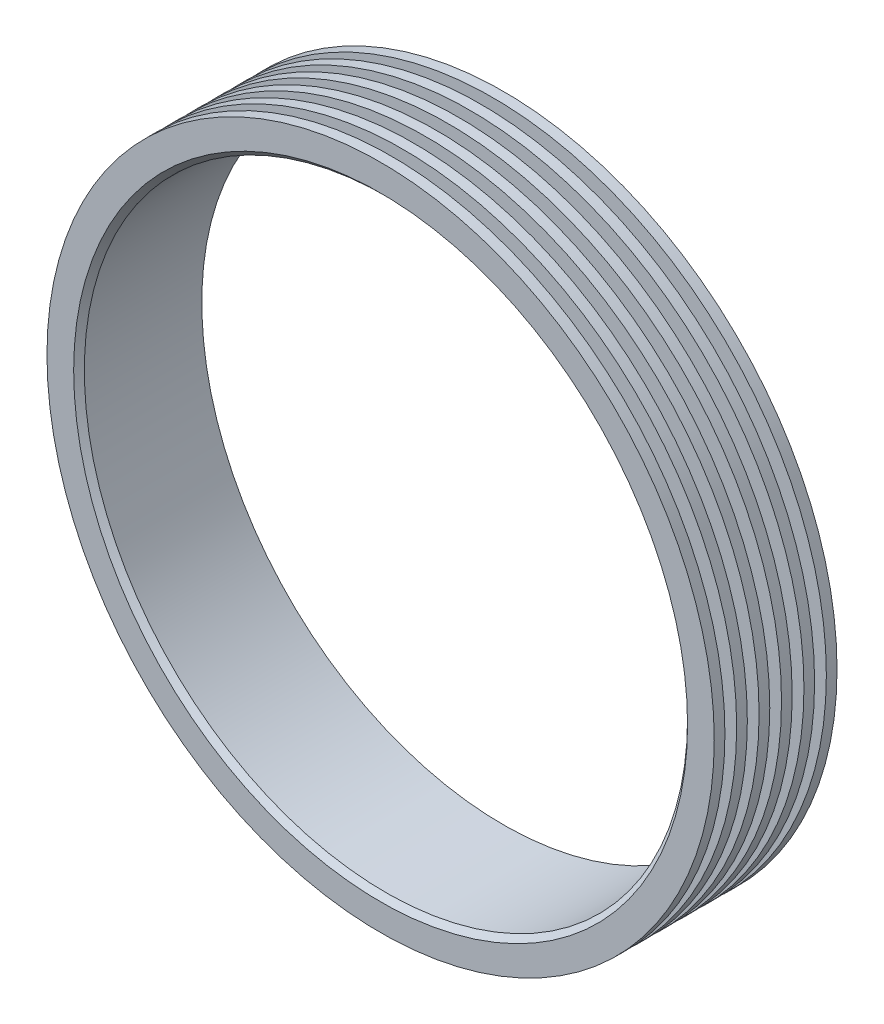
ISO-10303-21;
HEADER;
FILE_DESCRIPTION(('STEP AP214'),'2;1');
FILE_NAME('part.step','',(''),(''),'','','');
FILE_SCHEMA(('AUTOMOTIVE_DESIGN { 1 0 10303 214 1 1 1 1 }'));
ENDSEC;
DATA;
#1=APPLICATION_CONTEXT('core data for automotive mechanical design processes');
#2=APPLICATION_PROTOCOL_DEFINITION('international standard','automotive_design',2000,#1);
#3=PRODUCT_CONTEXT('',#1,'mechanical');
#4=PRODUCT('Part','Part','',(#3));
#5=PRODUCT_RELATED_PRODUCT_CATEGORY('part','',(#4));
#6=PRODUCT_DEFINITION_FORMATION('','',#4);
#7=PRODUCT_DEFINITION_CONTEXT('part definition',#1,'design');
#8=PRODUCT_DEFINITION('design','',#6,#7);
#9=PRODUCT_DEFINITION_SHAPE('','',#8);
#10=(LENGTH_UNIT() NAMED_UNIT(*) SI_UNIT(.MILLI.,.METRE.));
#11=(NAMED_UNIT(*) PLANE_ANGLE_UNIT() SI_UNIT($,.RADIAN.));
#12=(NAMED_UNIT(*) SI_UNIT($,.STERADIAN.) SOLID_ANGLE_UNIT());
#13=UNCERTAINTY_MEASURE_WITH_UNIT(LENGTH_MEASURE(1.E-05),#10,'distance_accuracy_value','');
#14=(GEOMETRIC_REPRESENTATION_CONTEXT(3) GLOBAL_UNCERTAINTY_ASSIGNED_CONTEXT((#13)) GLOBAL_UNIT_ASSIGNED_CONTEXT((#10,
#11,#12)) REPRESENTATION_CONTEXT('',''));
#15=CARTESIAN_POINT('',(0.,0.,0.));
#16=DIRECTION('',(0.,0.,1.));
#17=DIRECTION('',(1.,0.,0.));
#18=AXIS2_PLACEMENT_3D('',#15,#16,#17);
#19=CARTESIAN_POINT('',(0.,56.5,-11.5));
#20=DIRECTION('',(0.,0.,1.));
#21=DIRECTION('',(1.,0.,0.));
#22=AXIS2_PLACEMENT_3D('',#19,#20,#21);
#23=PLANE('',#22);
#24=CARTESIAN_POINT('',(0.,0.,-11.5));
#25=DIRECTION('',(0.,0.,1.));
#26=DIRECTION('',(1.,0.,0.));
#27=AXIS2_PLACEMENT_3D('',#24,#25,#26);
#28=CIRCLE('',#27,62.5);
#29=CARTESIAN_POINT('',(62.5,0.,-11.5));
#30=VERTEX_POINT('',#29);
#31=EDGE_CURVE('E39',#30,#30,#28,.T.);
#32=ORIENTED_EDGE('',*,*,#31,.F.);
#33=EDGE_LOOP('',(#32));
#34=FACE_BOUND('',#33,.T.);
#35=CARTESIAN_POINT('',(0.,0.,-11.5));
#36=DIRECTION('',(0.,0.,1.));
#37=DIRECTION('',(1.,0.,0.));
#38=AXIS2_PLACEMENT_3D('',#35,#36,#37);
#39=CIRCLE('',#38,56.5);
#40=CARTESIAN_POINT('',(56.5,0.,-11.5));
#41=VERTEX_POINT('',#40);
#42=EDGE_CURVE('E10',#41,#41,#39,.T.);
#43=ORIENTED_EDGE('',*,*,#42,.T.);
#44=EDGE_LOOP('',(#43));
#45=FACE_BOUND('',#44,.T.);
#46=ADVANCED_FACE('F33',(#34,#45),#23,.F.);
#47=CARTESIAN_POINT('',(0.,0.,0.));
#48=DIRECTION('',(0.,0.,1.));
#49=DIRECTION('',(1.,0.,0.));
#50=AXIS2_PLACEMENT_3D('',#47,#48,#49);
#51=CYLINDRICAL_SURFACE('',#50,62.5);
#52=CARTESIAN_POINT('',(0.,0.,-9.5));
#53=DIRECTION('',(0.,0.,1.));
#54=DIRECTION('',(1.,0.,0.));
#55=AXIS2_PLACEMENT_3D('',#52,#53,#54);
#56=CIRCLE('',#55,62.5);
#57=CARTESIAN_POINT('',(62.5,0.,-9.5));
#58=VERTEX_POINT('',#57);
#59=EDGE_CURVE('E43',#58,#58,#56,.T.);
#60=ORIENTED_EDGE('',*,*,#59,.F.);
#61=EDGE_LOOP('',(#60));
#62=FACE_BOUND('',#61,.T.);
#63=ORIENTED_EDGE('',*,*,#31,.T.);
#64=EDGE_LOOP('',(#63));
#65=FACE_BOUND('',#64,.T.);
#66=ADVANCED_FACE('F247',(#62,#65),#51,.T.);
#67=CARTESIAN_POINT('',(0.,62.5,-9.5));
#68=DIRECTION('',(0.,0.,-1.));
#69=DIRECTION('',(-1.,0.,0.));
#70=AXIS2_PLACEMENT_3D('',#67,#68,#69);
#71=PLANE('',#70);
#72=CARTESIAN_POINT('',(0.,0.,-9.5));
#73=DIRECTION('',(0.,0.,1.));
#74=DIRECTION('',(1.,0.,0.));
#75=AXIS2_PLACEMENT_3D('',#72,#73,#74);
#76=CIRCLE('',#75,58.5);
#77=CARTESIAN_POINT('',(58.5,0.,-9.5));
#78=VERTEX_POINT('',#77);
#79=EDGE_CURVE('E47',#78,#78,#76,.T.);
#80=ORIENTED_EDGE('',*,*,#79,.F.);
#81=EDGE_LOOP('',(#80));
#82=FACE_BOUND('',#81,.T.);
#83=ORIENTED_EDGE('',*,*,#59,.T.);
#84=EDGE_LOOP('',(#83));
#85=FACE_BOUND('',#84,.T.);
#86=ADVANCED_FACE('F241',(#82,#85),#71,.F.);
#87=CARTESIAN_POINT('',(0.,0.,0.));
#88=DIRECTION('',(0.,0.,1.));
#89=DIRECTION('',(1.,0.,0.));
#90=AXIS2_PLACEMENT_3D('',#87,#88,#89);
#91=CYLINDRICAL_SURFACE('',#90,58.5);
#92=CARTESIAN_POINT('',(0.,0.,-7.3));
#93=DIRECTION('',(0.,0.,1.));
#94=DIRECTION('',(1.,0.,0.));
#95=AXIS2_PLACEMENT_3D('',#92,#93,#94);
#96=CIRCLE('',#95,58.5);
#97=CARTESIAN_POINT('',(58.5,0.,-7.3));
#98=VERTEX_POINT('',#97);
#99=EDGE_CURVE('E52',#98,#98,#96,.T.);
#100=ORIENTED_EDGE('',*,*,#99,.F.);
#101=EDGE_LOOP('',(#100));
#102=FACE_BOUND('',#101,.T.);
#103=ORIENTED_EDGE('',*,*,#79,.T.);
#104=EDGE_LOOP('',(#103));
#105=FACE_BOUND('',#104,.T.);
#106=ADVANCED_FACE('F235',(#102,#105),#91,.T.);
#107=CARTESIAN_POINT('',(0.,62.5,-7.3));
#108=DIRECTION('',(0.,0.,1.));
#109=DIRECTION('',(1.,0.,0.));
#110=AXIS2_PLACEMENT_3D('',#107,#108,#109);
#111=PLANE('',#110);
#112=CARTESIAN_POINT('',(0.,0.,-7.3));
#113=DIRECTION('',(0.,0.,1.));
#114=DIRECTION('',(1.,0.,0.));
#115=AXIS2_PLACEMENT_3D('',#112,#113,#114);
#116=CIRCLE('',#115,62.5);
#117=CARTESIAN_POINT('',(62.5,0.,-7.3));
#118=VERTEX_POINT('',#117);
#119=EDGE_CURVE('E55',#118,#118,#116,.T.);
#120=ORIENTED_EDGE('',*,*,#119,.F.);
#121=EDGE_LOOP('',(#120));
#122=FACE_BOUND('',#121,.T.);
#123=ORIENTED_EDGE('',*,*,#99,.T.);
#124=EDGE_LOOP('',(#123));
#125=FACE_BOUND('',#124,.T.);
#126=ADVANCED_FACE('F229',(#122,#125),#111,.F.);
#127=CARTESIAN_POINT('',(0.,0.,0.));
#128=DIRECTION('',(0.,0.,1.));
#129=DIRECTION('',(1.,0.,0.));
#130=AXIS2_PLACEMENT_3D('',#127,#128,#129);
#131=CYLINDRICAL_SURFACE('',#130,62.5);
#132=CARTESIAN_POINT('',(0.,0.,-5.3));
#133=DIRECTION('',(0.,0.,1.));
#134=DIRECTION('',(1.,0.,0.));
#135=AXIS2_PLACEMENT_3D('',#132,#133,#134);
#136=CIRCLE('',#135,62.5);
#137=CARTESIAN_POINT('',(62.5,0.,-5.3));
#138=VERTEX_POINT('',#137);
#139=EDGE_CURVE('E58',#138,#138,#136,.T.);
#140=ORIENTED_EDGE('',*,*,#139,.F.);
#141=EDGE_LOOP('',(#140));
#142=FACE_BOUND('',#141,.T.);
#143=ORIENTED_EDGE('',*,*,#119,.T.);
#144=EDGE_LOOP('',(#143));
#145=FACE_BOUND('',#144,.T.);
#146=ADVANCED_FACE('F223',(#142,#145),#131,.T.);
#147=CARTESIAN_POINT('',(0.,62.5,-5.3));
#148=DIRECTION('',(0.,0.,-1.));
#149=DIRECTION('',(-1.,0.,0.));
#150=AXIS2_PLACEMENT_3D('',#147,#148,#149);
#151=PLANE('',#150);
#152=CARTESIAN_POINT('',(0.,0.,-5.3));
#153=DIRECTION('',(0.,0.,1.));
#154=DIRECTION('',(1.,0.,0.));
#155=AXIS2_PLACEMENT_3D('',#152,#153,#154);
#156=CIRCLE('',#155,58.5);
#157=CARTESIAN_POINT('',(58.5,0.,-5.3));
#158=VERTEX_POINT('',#157);
#159=EDGE_CURVE('E61',#158,#158,#156,.T.);
#160=ORIENTED_EDGE('',*,*,#159,.F.);
#161=EDGE_LOOP('',(#160));
#162=FACE_BOUND('',#161,.T.);
#163=ORIENTED_EDGE('',*,*,#139,.T.);
#164=EDGE_LOOP('',(#163));
#165=FACE_BOUND('',#164,.T.);
#166=ADVANCED_FACE('F217',(#162,#165),#151,.F.);
#167=CARTESIAN_POINT('',(0.,0.,0.));
#168=DIRECTION('',(0.,0.,1.));
#169=DIRECTION('',(1.,0.,0.));
#170=AXIS2_PLACEMENT_3D('',#167,#168,#169);
#171=CYLINDRICAL_SURFACE('',#170,58.5);
#172=CARTESIAN_POINT('',(0.,0.,-3.1));
#173=DIRECTION('',(0.,0.,1.));
#174=DIRECTION('',(1.,0.,0.));
#175=AXIS2_PLACEMENT_3D('',#172,#173,#174);
#176=CIRCLE('',#175,58.5);
#177=CARTESIAN_POINT('',(58.5,0.,-3.1));
#178=VERTEX_POINT('',#177);
#179=EDGE_CURVE('E64',#178,#178,#176,.T.);
#180=ORIENTED_EDGE('',*,*,#179,.F.);
#181=EDGE_LOOP('',(#180));
#182=FACE_BOUND('',#181,.T.);
#183=ORIENTED_EDGE('',*,*,#159,.T.);
#184=EDGE_LOOP('',(#183));
#185=FACE_BOUND('',#184,.T.);
#186=ADVANCED_FACE('F211',(#182,#185),#171,.T.);
#187=CARTESIAN_POINT('',(0.,62.4999999999999,-3.1));
#188=DIRECTION('',(0.,0.,1.));
#189=DIRECTION('',(1.,0.,0.));
#190=AXIS2_PLACEMENT_3D('',#187,#188,#189);
#191=PLANE('',#190);
#192=CARTESIAN_POINT('',(0.,0.,-3.1));
#193=DIRECTION('',(0.,0.,1.));
#194=DIRECTION('',(1.,0.,0.));
#195=AXIS2_PLACEMENT_3D('',#192,#193,#194);
#196=CIRCLE('',#195,62.4999999999999);
#197=CARTESIAN_POINT('',(62.4999999999999,0.,-3.1));
#198=VERTEX_POINT('',#197);
#199=EDGE_CURVE('E67',#198,#198,#196,.T.);
#200=ORIENTED_EDGE('',*,*,#199,.F.);
#201=EDGE_LOOP('',(#200));
#202=FACE_BOUND('',#201,.T.);
#203=ORIENTED_EDGE('',*,*,#179,.T.);
#204=EDGE_LOOP('',(#203));
#205=FACE_BOUND('',#204,.T.);
#206=ADVANCED_FACE('F205',(#202,#205),#191,.F.);
#207=CARTESIAN_POINT('',(0.,0.,0.));
#208=DIRECTION('',(0.,0.,1.));
#209=DIRECTION('',(1.,0.,0.));
#210=AXIS2_PLACEMENT_3D('',#207,#208,#209);
#211=CYLINDRICAL_SURFACE('',#210,62.4999999999999);
#212=CARTESIAN_POINT('',(0.,0.,-1.1));
#213=DIRECTION('',(0.,0.,1.));
#214=DIRECTION('',(1.,0.,0.));
#215=AXIS2_PLACEMENT_3D('',#212,#213,#214);
#216=CIRCLE('',#215,62.4999999999999);
#217=CARTESIAN_POINT('',(62.4999999999999,0.,-1.1));
#218=VERTEX_POINT('',#217);
#219=EDGE_CURVE('E70',#218,#218,#216,.T.);
#220=ORIENTED_EDGE('',*,*,#219,.F.);
#221=EDGE_LOOP('',(#220));
#222=FACE_BOUND('',#221,.T.);
#223=ORIENTED_EDGE('',*,*,#199,.T.);
#224=EDGE_LOOP('',(#223));
#225=FACE_BOUND('',#224,.T.);
#226=ADVANCED_FACE('F199',(#222,#225),#211,.T.);
#227=CARTESIAN_POINT('',(0.,62.4999999999999,-1.1));
#228=DIRECTION('',(0.,0.,-1.));
#229=DIRECTION('',(-1.,0.,0.));
#230=AXIS2_PLACEMENT_3D('',#227,#228,#229);
#231=PLANE('',#230);
#232=CARTESIAN_POINT('',(0.,0.,-1.1));
#233=DIRECTION('',(0.,0.,1.));
#234=DIRECTION('',(1.,0.,0.));
#235=AXIS2_PLACEMENT_3D('',#232,#233,#234);
#236=CIRCLE('',#235,58.4999999999999);
#237=CARTESIAN_POINT('',(58.4999999999999,0.,-1.1));
#238=VERTEX_POINT('',#237);
#239=EDGE_CURVE('E73',#238,#238,#236,.T.);
#240=ORIENTED_EDGE('',*,*,#239,.F.);
#241=EDGE_LOOP('',(#240));
#242=FACE_BOUND('',#241,.T.);
#243=ORIENTED_EDGE('',*,*,#219,.T.);
#244=EDGE_LOOP('',(#243));
#245=FACE_BOUND('',#244,.T.);
#246=ADVANCED_FACE('F193',(#242,#245),#231,.F.);
#247=CARTESIAN_POINT('',(0.,0.,0.));
#248=DIRECTION('',(0.,0.,1.));
#249=DIRECTION('',(1.,0.,0.));
#250=AXIS2_PLACEMENT_3D('',#247,#248,#249);
#251=CYLINDRICAL_SURFACE('',#250,58.4999999999999);
#252=CARTESIAN_POINT('',(0.,0.,1.1));
#253=DIRECTION('',(0.,0.,1.));
#254=DIRECTION('',(1.,0.,0.));
#255=AXIS2_PLACEMENT_3D('',#252,#253,#254);
#256=CIRCLE('',#255,58.4999999999999);
#257=CARTESIAN_POINT('',(58.4999999999999,0.,1.1));
#258=VERTEX_POINT('',#257);
#259=EDGE_CURVE('E76',#258,#258,#256,.T.);
#260=ORIENTED_EDGE('',*,*,#259,.F.);
#261=EDGE_LOOP('',(#260));
#262=FACE_BOUND('',#261,.T.);
#263=ORIENTED_EDGE('',*,*,#239,.T.);
#264=EDGE_LOOP('',(#263));
#265=FACE_BOUND('',#264,.T.);
#266=ADVANCED_FACE('F187',(#262,#265),#251,.T.);
#267=CARTESIAN_POINT('',(0.,62.4999999999999,1.1));
#268=DIRECTION('',(0.,0.,1.));
#269=DIRECTION('',(1.,0.,0.));
#270=AXIS2_PLACEMENT_3D('',#267,#268,#269);
#271=PLANE('',#270);
#272=CARTESIAN_POINT('',(0.,0.,1.1));
#273=DIRECTION('',(0.,0.,1.));
#274=DIRECTION('',(1.,0.,0.));
#275=AXIS2_PLACEMENT_3D('',#272,#273,#274);
#276=CIRCLE('',#275,62.4999999999999);
#277=CARTESIAN_POINT('',(62.4999999999999,0.,1.1));
#278=VERTEX_POINT('',#277);
#279=EDGE_CURVE('E79',#278,#278,#276,.T.);
#280=ORIENTED_EDGE('',*,*,#279,.F.);
#281=EDGE_LOOP('',(#280));
#282=FACE_BOUND('',#281,.T.);
#283=ORIENTED_EDGE('',*,*,#259,.T.);
#284=EDGE_LOOP('',(#283));
#285=FACE_BOUND('',#284,.T.);
#286=ADVANCED_FACE('F181',(#282,#285),#271,.F.);
#287=CARTESIAN_POINT('',(0.,0.,0.));
#288=DIRECTION('',(0.,0.,1.));
#289=DIRECTION('',(1.,0.,0.));
#290=AXIS2_PLACEMENT_3D('',#287,#288,#289);
#291=CYLINDRICAL_SURFACE('',#290,62.4999999999999);
#292=CARTESIAN_POINT('',(0.,0.,3.1));
#293=DIRECTION('',(0.,0.,1.));
#294=DIRECTION('',(1.,0.,0.));
#295=AXIS2_PLACEMENT_3D('',#292,#293,#294);
#296=CIRCLE('',#295,62.4999999999999);
#297=CARTESIAN_POINT('',(62.4999999999999,0.,3.1));
#298=VERTEX_POINT('',#297);
#299=EDGE_CURVE('E82',#298,#298,#296,.T.);
#300=ORIENTED_EDGE('',*,*,#299,.F.);
#301=EDGE_LOOP('',(#300));
#302=FACE_BOUND('',#301,.T.);
#303=ORIENTED_EDGE('',*,*,#279,.T.);
#304=EDGE_LOOP('',(#303));
#305=FACE_BOUND('',#304,.T.);
#306=ADVANCED_FACE('F175',(#302,#305),#291,.T.);
#307=CARTESIAN_POINT('',(0.,62.4999999999999,3.1));
#308=DIRECTION('',(0.,0.,-1.));
#309=DIRECTION('',(-1.,0.,0.));
#310=AXIS2_PLACEMENT_3D('',#307,#308,#309);
#311=PLANE('',#310);
#312=CARTESIAN_POINT('',(0.,0.,3.1));
#313=DIRECTION('',(0.,0.,1.));
#314=DIRECTION('',(1.,0.,0.));
#315=AXIS2_PLACEMENT_3D('',#312,#313,#314);
#316=CIRCLE('',#315,58.4999999999999);
#317=CARTESIAN_POINT('',(58.4999999999999,0.,3.1));
#318=VERTEX_POINT('',#317);
#319=EDGE_CURVE('E85',#318,#318,#316,.T.);
#320=ORIENTED_EDGE('',*,*,#319,.F.);
#321=EDGE_LOOP('',(#320));
#322=FACE_BOUND('',#321,.T.);
#323=ORIENTED_EDGE('',*,*,#299,.T.);
#324=EDGE_LOOP('',(#323));
#325=FACE_BOUND('',#324,.T.);
#326=ADVANCED_FACE('F169',(#322,#325),#311,.F.);
#327=CARTESIAN_POINT('',(0.,0.,0.));
#328=DIRECTION('',(0.,0.,1.));
#329=DIRECTION('',(1.,0.,0.));
#330=AXIS2_PLACEMENT_3D('',#327,#328,#329);
#331=CYLINDRICAL_SURFACE('',#330,58.4999999999999);
#332=CARTESIAN_POINT('',(0.,0.,5.3));
#333=DIRECTION('',(0.,0.,1.));
#334=DIRECTION('',(1.,0.,0.));
#335=AXIS2_PLACEMENT_3D('',#332,#333,#334);
#336=CIRCLE('',#335,58.4999999999999);
#337=CARTESIAN_POINT('',(58.4999999999999,0.,5.3));
#338=VERTEX_POINT('',#337);
#339=EDGE_CURVE('E88',#338,#338,#336,.T.);
#340=ORIENTED_EDGE('',*,*,#339,.F.);
#341=EDGE_LOOP('',(#340));
#342=FACE_BOUND('',#341,.T.);
#343=ORIENTED_EDGE('',*,*,#319,.T.);
#344=EDGE_LOOP('',(#343));
#345=FACE_BOUND('',#344,.T.);
#346=ADVANCED_FACE('F163',(#342,#345),#331,.T.);
#347=CARTESIAN_POINT('',(0.,62.4999999999999,5.3));
#348=DIRECTION('',(0.,0.,1.));
#349=DIRECTION('',(1.,0.,0.));
#350=AXIS2_PLACEMENT_3D('',#347,#348,#349);
#351=PLANE('',#350);
#352=CARTESIAN_POINT('',(0.,0.,5.3));
#353=DIRECTION('',(0.,0.,1.));
#354=DIRECTION('',(1.,0.,0.));
#355=AXIS2_PLACEMENT_3D('',#352,#353,#354);
#356=CIRCLE('',#355,62.4999999999999);
#357=CARTESIAN_POINT('',(62.4999999999999,0.,5.3));
#358=VERTEX_POINT('',#357);
#359=EDGE_CURVE('E91',#358,#358,#356,.T.);
#360=ORIENTED_EDGE('',*,*,#359,.F.);
#361=EDGE_LOOP('',(#360));
#362=FACE_BOUND('',#361,.T.);
#363=ORIENTED_EDGE('',*,*,#339,.T.);
#364=EDGE_LOOP('',(#363));
#365=FACE_BOUND('',#364,.T.);
#366=ADVANCED_FACE('F157',(#362,#365),#351,.F.);
#367=CARTESIAN_POINT('',(0.,0.,0.));
#368=DIRECTION('',(0.,0.,1.));
#369=DIRECTION('',(1.,0.,0.));
#370=AXIS2_PLACEMENT_3D('',#367,#368,#369);
#371=CYLINDRICAL_SURFACE('',#370,62.4999999999999);
#372=CARTESIAN_POINT('',(0.,0.,7.3));
#373=DIRECTION('',(0.,0.,1.));
#374=DIRECTION('',(1.,0.,0.));
#375=AXIS2_PLACEMENT_3D('',#372,#373,#374);
#376=CIRCLE('',#375,62.4999999999999);
#377=CARTESIAN_POINT('',(62.4999999999999,0.,7.3));
#378=VERTEX_POINT('',#377);
#379=EDGE_CURVE('E94',#378,#378,#376,.T.);
#380=ORIENTED_EDGE('',*,*,#379,.F.);
#381=EDGE_LOOP('',(#380));
#382=FACE_BOUND('',#381,.T.);
#383=ORIENTED_EDGE('',*,*,#359,.T.);
#384=EDGE_LOOP('',(#383));
#385=FACE_BOUND('',#384,.T.);
#386=ADVANCED_FACE('F151',(#382,#385),#371,.T.);
#387=CARTESIAN_POINT('',(0.,62.4999999999999,7.3));
#388=DIRECTION('',(0.,0.,-1.));
#389=DIRECTION('',(-1.,0.,0.));
#390=AXIS2_PLACEMENT_3D('',#387,#388,#389);
#391=PLANE('',#390);
#392=CARTESIAN_POINT('',(0.,0.,7.3));
#393=DIRECTION('',(0.,0.,1.));
#394=DIRECTION('',(1.,0.,0.));
#395=AXIS2_PLACEMENT_3D('',#392,#393,#394);
#396=CIRCLE('',#395,58.4999999999999);
#397=CARTESIAN_POINT('',(58.4999999999999,0.,7.3));
#398=VERTEX_POINT('',#397);
#399=EDGE_CURVE('E97',#398,#398,#396,.T.);
#400=ORIENTED_EDGE('',*,*,#399,.F.);
#401=EDGE_LOOP('',(#400));
#402=FACE_BOUND('',#401,.T.);
#403=ORIENTED_EDGE('',*,*,#379,.T.);
#404=EDGE_LOOP('',(#403));
#405=FACE_BOUND('',#404,.T.);
#406=ADVANCED_FACE('F145',(#402,#405),#391,.F.);
#407=CARTESIAN_POINT('',(0.,0.,0.));
#408=DIRECTION('',(0.,0.,1.));
#409=DIRECTION('',(1.,0.,0.));
#410=AXIS2_PLACEMENT_3D('',#407,#408,#409);
#411=CYLINDRICAL_SURFACE('',#410,58.4999999999999);
#412=CARTESIAN_POINT('',(0.,0.,9.50000000000001));
#413=DIRECTION('',(0.,0.,1.));
#414=DIRECTION('',(1.,0.,0.));
#415=AXIS2_PLACEMENT_3D('',#412,#413,#414);
#416=CIRCLE('',#415,58.4999999999999);
#417=CARTESIAN_POINT('',(58.4999999999999,0.,9.50000000000001));
#418=VERTEX_POINT('',#417);
#419=EDGE_CURVE('E100',#418,#418,#416,.T.);
#420=ORIENTED_EDGE('',*,*,#419,.F.);
#421=EDGE_LOOP('',(#420));
#422=FACE_BOUND('',#421,.T.);
#423=ORIENTED_EDGE('',*,*,#399,.T.);
#424=EDGE_LOOP('',(#423));
#425=FACE_BOUND('',#424,.T.);
#426=ADVANCED_FACE('F139',(#422,#425),#411,.T.);
#427=CARTESIAN_POINT('',(0.,62.4999999999999,9.50000000000001));
#428=DIRECTION('',(0.,0.,1.));
#429=DIRECTION('',(1.,0.,0.));
#430=AXIS2_PLACEMENT_3D('',#427,#428,#429);
#431=PLANE('',#430);
#432=CARTESIAN_POINT('',(0.,0.,9.50000000000001));
#433=DIRECTION('',(0.,0.,1.));
#434=DIRECTION('',(1.,0.,0.));
#435=AXIS2_PLACEMENT_3D('',#432,#433,#434);
#436=CIRCLE('',#435,62.4999999999999);
#437=CARTESIAN_POINT('',(62.4999999999999,0.,9.50000000000001));
#438=VERTEX_POINT('',#437);
#439=EDGE_CURVE('E103',#438,#438,#436,.T.);
#440=ORIENTED_EDGE('',*,*,#439,.F.);
#441=EDGE_LOOP('',(#440));
#442=FACE_BOUND('',#441,.T.);
#443=ORIENTED_EDGE('',*,*,#419,.T.);
#444=EDGE_LOOP('',(#443));
#445=FACE_BOUND('',#444,.T.);
#446=ADVANCED_FACE('F133',(#442,#445),#431,.F.);
#447=CARTESIAN_POINT('',(0.,0.,0.));
#448=DIRECTION('',(0.,0.,1.));
#449=DIRECTION('',(1.,0.,0.));
#450=AXIS2_PLACEMENT_3D('',#447,#448,#449);
#451=CYLINDRICAL_SURFACE('',#450,62.4999999999999);
#452=CARTESIAN_POINT('',(0.,0.,11.5));
#453=DIRECTION('',(0.,0.,1.));
#454=DIRECTION('',(1.,0.,0.));
#455=AXIS2_PLACEMENT_3D('',#452,#453,#454);
#456=CIRCLE('',#455,62.5);
#457=CARTESIAN_POINT('',(62.5,0.,11.5));
#458=VERTEX_POINT('',#457);
#459=EDGE_CURVE('E106',#458,#458,#456,.T.);
#460=ORIENTED_EDGE('',*,*,#459,.F.);
#461=EDGE_LOOP('',(#460));
#462=FACE_BOUND('',#461,.T.);
#463=ORIENTED_EDGE('',*,*,#439,.T.);
#464=EDGE_LOOP('',(#463));
#465=FACE_BOUND('',#464,.T.);
#466=ADVANCED_FACE('F127',(#462,#465),#451,.T.);
#467=CARTESIAN_POINT('',(0.,57.5,11.5));
#468=DIRECTION('',(0.,0.,-1.));
#469=DIRECTION('',(-1.,0.,0.));
#470=AXIS2_PLACEMENT_3D('',#467,#468,#469);
#471=PLANE('',#470);
#472=CARTESIAN_POINT('',(0.,0.,11.5));
#473=DIRECTION('',(0.,0.,1.));
#474=DIRECTION('',(1.,0.,0.));
#475=AXIS2_PLACEMENT_3D('',#472,#473,#474);
#476=CIRCLE('',#475,57.5);
#477=CARTESIAN_POINT('',(57.5,0.,11.5));
#478=VERTEX_POINT('',#477);
#479=EDGE_CURVE('E109',#478,#478,#476,.T.);
#480=ORIENTED_EDGE('',*,*,#479,.F.);
#481=EDGE_LOOP('',(#480));
#482=FACE_BOUND('',#481,.T.);
#483=ORIENTED_EDGE('',*,*,#459,.T.);
#484=EDGE_LOOP('',(#483));
#485=FACE_BOUND('',#484,.T.);
#486=ADVANCED_FACE('F121',(#482,#485),#471,.F.);
#487=CARTESIAN_POINT('',(0.,0.,11.5));
#488=DIRECTION('',(0.,0.,1.));
#489=DIRECTION('',(1.,0.,0.));
#490=AXIS2_PLACEMENT_3D('',#487,#488,#489);
#491=CONICAL_SURFACE('',#490,57.5,0.785398163397448);
#492=CARTESIAN_POINT('',(0.,0.,10.5));
#493=DIRECTION('',(0.,0.,1.));
#494=DIRECTION('',(1.,0.,0.));
#495=AXIS2_PLACEMENT_3D('',#492,#493,#494);
#496=CIRCLE('',#495,56.5);
#497=CARTESIAN_POINT('',(56.5,0.,10.5));
#498=VERTEX_POINT('',#497);
#499=EDGE_CURVE('E112',#498,#498,#496,.T.);
#500=ORIENTED_EDGE('',*,*,#499,.F.);
#501=EDGE_LOOP('',(#500));
#502=FACE_BOUND('',#501,.T.);
#503=ORIENTED_EDGE('',*,*,#479,.T.);
#504=EDGE_LOOP('',(#503));
#505=FACE_BOUND('',#504,.T.);
#506=ADVANCED_FACE('F118',(#502,#505),#491,.F.);
#507=CARTESIAN_POINT('',(0.,0.,0.));
#508=DIRECTION('',(0.,0.,1.));
#509=DIRECTION('',(1.,0.,0.));
#510=AXIS2_PLACEMENT_3D('',#507,#508,#509);
#511=CYLINDRICAL_SURFACE('',#510,56.5);
#512=ORIENTED_EDGE('',*,*,#42,.F.);
#513=EDGE_LOOP('',(#512));
#514=FACE_BOUND('',#513,.T.);
#515=ORIENTED_EDGE('',*,*,#499,.T.);
#516=EDGE_LOOP('',(#515));
#517=FACE_BOUND('',#516,.T.);
#518=ADVANCED_FACE('F116',(#514,#517),#511,.F.);
#519=CLOSED_SHELL('',(#46,#66,#86,#106,#126,#146,#166,#186,#206,#226,#246,#266,#286,#306,#326,
#346,#366,#386,#406,#426,#446,#466,#486,#506,#518));
#520=MANIFOLD_SOLID_BREP('B2',#519);
#521=ADVANCED_BREP_SHAPE_REPRESENTATION('',(#18,#520),#14);
#522=SHAPE_DEFINITION_REPRESENTATION(#9,#521);
ENDSEC;
END-ISO-10303-21;
